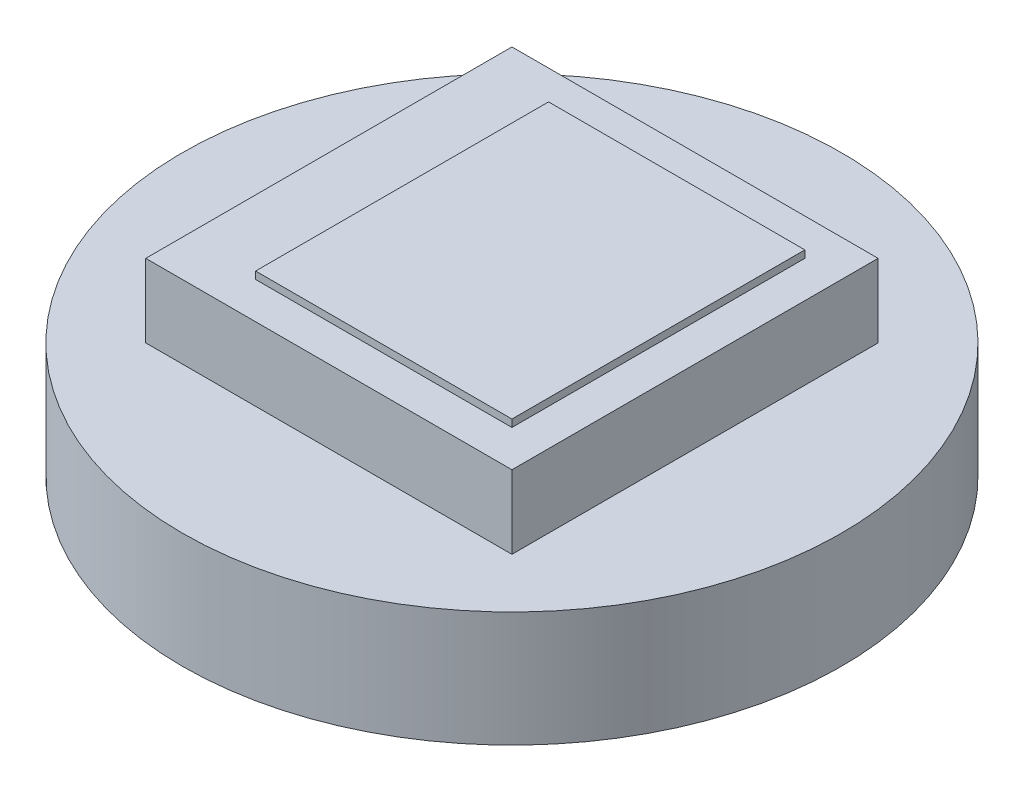
ISO-10303-21;
HEADER;
FILE_DESCRIPTION(('STEP AP214'),'2;1');
FILE_NAME('part.step','',(''),(''),'','','');
FILE_SCHEMA(('AUTOMOTIVE_DESIGN { 1 0 10303 214 1 1 1 1 }'));
ENDSEC;
DATA;
#1=APPLICATION_CONTEXT('core data for automotive mechanical design processes');
#2=APPLICATION_PROTOCOL_DEFINITION('international standard','automotive_design',2000,#1);
#3=PRODUCT_CONTEXT('',#1,'mechanical');
#4=PRODUCT('Part','Part','',(#3));
#5=PRODUCT_RELATED_PRODUCT_CATEGORY('part','',(#4));
#6=PRODUCT_DEFINITION_FORMATION('','',#4);
#7=PRODUCT_DEFINITION_CONTEXT('part definition',#1,'design');
#8=PRODUCT_DEFINITION('design','',#6,#7);
#9=PRODUCT_DEFINITION_SHAPE('','',#8);
#10=(LENGTH_UNIT() NAMED_UNIT(*) SI_UNIT(.MILLI.,.METRE.));
#11=(NAMED_UNIT(*) PLANE_ANGLE_UNIT() SI_UNIT($,.RADIAN.));
#12=(NAMED_UNIT(*) SI_UNIT($,.STERADIAN.) SOLID_ANGLE_UNIT());
#13=UNCERTAINTY_MEASURE_WITH_UNIT(LENGTH_MEASURE(1.E-05),#10,'distance_accuracy_value','');
#14=(GEOMETRIC_REPRESENTATION_CONTEXT(3) GLOBAL_UNCERTAINTY_ASSIGNED_CONTEXT((#13)) GLOBAL_UNIT_ASSIGNED_CONTEXT((#10,
#11,#12)) REPRESENTATION_CONTEXT('',''));
#15=CARTESIAN_POINT('',(0.,0.,0.));
#16=DIRECTION('',(0.,0.,1.));
#17=DIRECTION('',(1.,0.,0.));
#18=AXIS2_PLACEMENT_3D('',#15,#16,#17);
#19=CARTESIAN_POINT('',(-2.5,2.5748,2.5));
#20=DIRECTION('',(0.,1.,0.));
#21=DIRECTION('',(0.,0.,1.));
#22=AXIS2_PLACEMENT_3D('',#19,#20,#21);
#23=PLANE('',#22);
#24=DIRECTION('',(0.,0.,1.));
#25=VECTOR('',#24,1.);
#26=CARTESIAN_POINT('',(-2.5,2.5748,-2.5));
#27=LINE('',#26,#25);
#28=CARTESIAN_POINT('',(-2.5,2.5748,-2.5));
#29=VERTEX_POINT('',#28);
#30=CARTESIAN_POINT('',(-2.5,2.5748,2.5));
#31=VERTEX_POINT('',#30);
#32=EDGE_CURVE('E130',#29,#31,#27,.T.);
#33=ORIENTED_EDGE('',*,*,#32,.T.);
#34=DIRECTION('',(1.,0.,0.));
#35=VECTOR('',#34,1.);
#36=CARTESIAN_POINT('',(-2.5,2.5748,2.5));
#37=LINE('',#36,#35);
#38=CARTESIAN_POINT('',(2.5,2.5748,2.5));
#39=VERTEX_POINT('',#38);
#40=EDGE_CURVE('E133',#31,#39,#37,.T.);
#41=ORIENTED_EDGE('',*,*,#40,.T.);
#42=DIRECTION('',(0.,0.,-1.));
#43=VECTOR('',#42,1.);
#44=CARTESIAN_POINT('',(2.5,2.5748,-2.5));
#45=LINE('',#44,#43);
#46=CARTESIAN_POINT('',(2.5,2.5748,-2.5));
#47=VERTEX_POINT('',#46);
#48=EDGE_CURVE('E136',#39,#47,#45,.T.);
#49=ORIENTED_EDGE('',*,*,#48,.T.);
#50=DIRECTION('',(-1.,0.,0.));
#51=VECTOR('',#50,1.);
#52=CARTESIAN_POINT('',(-2.5,2.5748,-2.5));
#53=LINE('',#52,#51);
#54=EDGE_CURVE('E138',#47,#29,#53,.T.);
#55=ORIENTED_EDGE('',*,*,#54,.T.);
#56=EDGE_LOOP('',(#33,#41,#49,#55));
#57=FACE_BOUND('',#56,.T.);
#58=DIRECTION('',(1.,0.,0.));
#59=VECTOR('',#58,1.);
#60=CARTESIAN_POINT('',(-1.5,2.5748,2.));
#61=LINE('',#60,#59);
#62=CARTESIAN_POINT('',(-1.5,2.5748,2.));
#63=VERTEX_POINT('',#62);
#64=CARTESIAN_POINT('',(2.,2.5748,2.));
#65=VERTEX_POINT('',#64);
#66=EDGE_CURVE('E290',#63,#65,#61,.T.);
#67=ORIENTED_EDGE('',*,*,#66,.F.);
#68=DIRECTION('',(0.,0.,1.));
#69=VECTOR('',#68,1.);
#70=CARTESIAN_POINT('',(-1.5,2.5748,-2.));
#71=LINE('',#70,#69);
#72=CARTESIAN_POINT('',(-1.5,2.5748,-2.));
#73=VERTEX_POINT('',#72);
#74=EDGE_CURVE('E120',#73,#63,#71,.T.);
#75=ORIENTED_EDGE('',*,*,#74,.F.);
#76=DIRECTION('',(-1.,0.,0.));
#77=VECTOR('',#76,1.);
#78=CARTESIAN_POINT('',(-1.5,2.5748,-2.));
#79=LINE('',#78,#77);
#80=CARTESIAN_POINT('',(2.,2.5748,-2.));
#81=VERTEX_POINT('',#80);
#82=EDGE_CURVE('E116',#81,#73,#79,.T.);
#83=ORIENTED_EDGE('',*,*,#82,.F.);
#84=DIRECTION('',(0.,0.,-1.));
#85=VECTOR('',#84,1.);
#86=CARTESIAN_POINT('',(2.,2.5748,-2.));
#87=LINE('',#86,#85);
#88=EDGE_CURVE('E287',#65,#81,#87,.T.);
#89=ORIENTED_EDGE('',*,*,#88,.F.);
#90=EDGE_LOOP('',(#67,#75,#83,#89));
#91=FACE_BOUND('',#90,.T.);
#92=ADVANCED_FACE('F31',(#57,#91),#23,.T.);
#93=CARTESIAN_POINT('',(0.,1.5748,0.));
#94=DIRECTION('',(0.,1.,0.));
#95=DIRECTION('',(0.,0.,1.));
#96=AXIS2_PLACEMENT_3D('',#93,#94,#95);
#97=PLANE('',#96);
#98=CARTESIAN_POINT('',(0.,1.5748,0.));
#99=DIRECTION('',(0.,1.,0.));
#100=DIRECTION('',(0.,0.,1.));
#101=AXIS2_PLACEMENT_3D('',#98,#99,#100);
#102=CIRCLE('',#101,4.5);
#103=CARTESIAN_POINT('',(0.,1.5748,4.5));
#104=VERTEX_POINT('',#103);
#105=EDGE_CURVE('E11',#104,#104,#102,.T.);
#106=ORIENTED_EDGE('',*,*,#105,.T.);
#107=EDGE_LOOP('',(#106));
#108=FACE_BOUND('',#107,.T.);
#109=DIRECTION('',(1.,0.,0.));
#110=VECTOR('',#109,1.);
#111=CARTESIAN_POINT('',(-2.5,1.5748,2.5));
#112=LINE('',#111,#110);
#113=CARTESIAN_POINT('',(-2.5,1.5748,2.5));
#114=VERTEX_POINT('',#113);
#115=CARTESIAN_POINT('',(2.5,1.5748,2.5));
#116=VERTEX_POINT('',#115);
#117=EDGE_CURVE('E125',#114,#116,#112,.T.);
#118=ORIENTED_EDGE('',*,*,#117,.F.);
#119=DIRECTION('',(0.,0.,1.));
#120=VECTOR('',#119,1.);
#121=CARTESIAN_POINT('',(-2.5,1.5748,-2.5));
#122=LINE('',#121,#120);
#123=CARTESIAN_POINT('',(-2.5,1.5748,-2.5));
#124=VERTEX_POINT('',#123);
#125=EDGE_CURVE('E122',#124,#114,#122,.T.);
#126=ORIENTED_EDGE('',*,*,#125,.F.);
#127=DIRECTION('',(-1.,0.,0.));
#128=VECTOR('',#127,1.);
#129=CARTESIAN_POINT('',(-2.5,1.5748,-2.5));
#130=LINE('',#129,#128);
#131=CARTESIAN_POINT('',(2.5,1.5748,-2.5));
#132=VERTEX_POINT('',#131);
#133=EDGE_CURVE('E134',#132,#124,#130,.T.);
#134=ORIENTED_EDGE('',*,*,#133,.F.);
#135=DIRECTION('',(0.,0.,-1.));
#136=VECTOR('',#135,1.);
#137=CARTESIAN_POINT('',(2.5,1.5748,-2.5));
#138=LINE('',#137,#136);
#139=EDGE_CURVE('E142',#116,#132,#138,.T.);
#140=ORIENTED_EDGE('',*,*,#139,.F.);
#141=EDGE_LOOP('',(#118,#126,#134,#140));
#142=FACE_BOUND('',#141,.T.);
#143=ADVANCED_FACE('F169',(#108,#142),#97,.T.);
#144=CARTESIAN_POINT('',(0.,1.5748,0.));
#145=DIRECTION('',(0.,-1.,0.));
#146=DIRECTION('',(0.,0.,-1.));
#147=AXIS2_PLACEMENT_3D('',#144,#145,#146);
#148=CYLINDRICAL_SURFACE('',#147,4.5);
#149=ORIENTED_EDGE('',*,*,#105,.F.);
#150=EDGE_LOOP('',(#149));
#151=FACE_BOUND('',#150,.T.);
#152=CARTESIAN_POINT('',(0.,0.,0.));
#153=DIRECTION('',(0.,1.,0.));
#154=DIRECTION('',(0.,0.,1.));
#155=AXIS2_PLACEMENT_3D('',#152,#153,#154);
#156=CIRCLE('',#155,4.5);
#157=CARTESIAN_POINT('',(0.,0.,4.5));
#158=VERTEX_POINT('',#157);
#159=EDGE_CURVE('E35',#158,#158,#156,.T.);
#160=ORIENTED_EDGE('',*,*,#159,.T.);
#161=EDGE_LOOP('',(#160));
#162=FACE_BOUND('',#161,.T.);
#163=ADVANCED_FACE('F33',(#151,#162),#148,.T.);
#164=CARTESIAN_POINT('',(0.,0.,0.));
#165=DIRECTION('',(0.,1.,0.));
#166=DIRECTION('',(0.,0.,1.));
#167=AXIS2_PLACEMENT_3D('',#164,#165,#166);
#168=PLANE('',#167);
#169=ORIENTED_EDGE('',*,*,#159,.F.);
#170=EDGE_LOOP('',(#169));
#171=FACE_BOUND('',#170,.T.);
#172=ADVANCED_FACE('F158',(#171),#168,.F.);
#173=CARTESIAN_POINT('',(-2.5,2.5748,-2.5));
#174=DIRECTION('',(1.,0.,0.));
#175=DIRECTION('',(0.,0.,-1.));
#176=AXIS2_PLACEMENT_3D('',#173,#174,#175);
#177=PLANE('',#176);
#178=ORIENTED_EDGE('',*,*,#125,.T.);
#179=DIRECTION('',(0.,-1.,0.));
#180=VECTOR('',#179,1.);
#181=CARTESIAN_POINT('',(-2.5,2.5748,2.5));
#182=LINE('',#181,#180);
#183=EDGE_CURVE('E151',#31,#114,#182,.T.);
#184=ORIENTED_EDGE('',*,*,#183,.F.);
#185=ORIENTED_EDGE('',*,*,#32,.F.);
#186=DIRECTION('',(0.,-1.,0.));
#187=VECTOR('',#186,1.);
#188=CARTESIAN_POINT('',(-2.5,2.5748,-2.5));
#189=LINE('',#188,#187);
#190=EDGE_CURVE('E139',#29,#124,#189,.T.);
#191=ORIENTED_EDGE('',*,*,#190,.T.);
#192=EDGE_LOOP('',(#178,#184,#185,#191));
#193=FACE_BOUND('',#192,.T.);
#194=ADVANCED_FACE('F160',(#193),#177,.F.);
#195=CARTESIAN_POINT('',(-2.5,2.5748,2.5));
#196=DIRECTION('',(0.,0.,-1.));
#197=DIRECTION('',(-1.,0.,0.));
#198=AXIS2_PLACEMENT_3D('',#195,#196,#197);
#199=PLANE('',#198);
#200=ORIENTED_EDGE('',*,*,#117,.T.);
#201=DIRECTION('',(0.,-1.,0.));
#202=VECTOR('',#201,1.);
#203=CARTESIAN_POINT('',(2.5,2.5748,2.5));
#204=LINE('',#203,#202);
#205=EDGE_CURVE('E148',#39,#116,#204,.T.);
#206=ORIENTED_EDGE('',*,*,#205,.F.);
#207=ORIENTED_EDGE('',*,*,#40,.F.);
#208=ORIENTED_EDGE('',*,*,#183,.T.);
#209=EDGE_LOOP('',(#200,#206,#207,#208));
#210=FACE_BOUND('',#209,.T.);
#211=ADVANCED_FACE('F166',(#210),#199,.F.);
#212=CARTESIAN_POINT('',(2.5,2.5748,-2.5));
#213=DIRECTION('',(-1.,0.,0.));
#214=DIRECTION('',(0.,0.,1.));
#215=AXIS2_PLACEMENT_3D('',#212,#213,#214);
#216=PLANE('',#215);
#217=ORIENTED_EDGE('',*,*,#139,.T.);
#218=DIRECTION('',(0.,-1.,0.));
#219=VECTOR('',#218,1.);
#220=CARTESIAN_POINT('',(2.5,2.5748,-2.5));
#221=LINE('',#220,#219);
#222=EDGE_CURVE('E54',#47,#132,#221,.T.);
#223=ORIENTED_EDGE('',*,*,#222,.F.);
#224=ORIENTED_EDGE('',*,*,#48,.F.);
#225=ORIENTED_EDGE('',*,*,#205,.T.);
#226=EDGE_LOOP('',(#217,#223,#224,#225));
#227=FACE_BOUND('',#226,.T.);
#228=ADVANCED_FACE('F186',(#227),#216,.F.);
#229=CARTESIAN_POINT('',(-2.5,2.5748,-2.5));
#230=DIRECTION('',(0.,0.,1.));
#231=DIRECTION('',(1.,0.,0.));
#232=AXIS2_PLACEMENT_3D('',#229,#230,#231);
#233=PLANE('',#232);
#234=ORIENTED_EDGE('',*,*,#133,.T.);
#235=ORIENTED_EDGE('',*,*,#190,.F.);
#236=ORIENTED_EDGE('',*,*,#54,.F.);
#237=ORIENTED_EDGE('',*,*,#222,.T.);
#238=EDGE_LOOP('',(#234,#235,#236,#237));
#239=FACE_BOUND('',#238,.T.);
#240=ADVANCED_FACE('F183',(#239),#233,.F.);
#241=CARTESIAN_POINT('',(-1.5,2.6748,-2.));
#242=DIRECTION('',(1.,0.,0.));
#243=DIRECTION('',(0.,0.,-1.));
#244=AXIS2_PLACEMENT_3D('',#241,#242,#243);
#245=PLANE('',#244);
#246=ORIENTED_EDGE('',*,*,#74,.T.);
#247=DIRECTION('',(0.,-1.,0.));
#248=VECTOR('',#247,1.);
#249=CARTESIAN_POINT('',(-1.5,2.6748,2.));
#250=LINE('',#249,#248);
#251=CARTESIAN_POINT('',(-1.5,2.6748,2.));
#252=VERTEX_POINT('',#251);
#253=EDGE_CURVE('E101',#252,#63,#250,.T.);
#254=ORIENTED_EDGE('',*,*,#253,.F.);
#255=DIRECTION('',(0.,0.,1.));
#256=VECTOR('',#255,1.);
#257=CARTESIAN_POINT('',(-1.5,2.6748,-2.));
#258=LINE('',#257,#256);
#259=CARTESIAN_POINT('',(-1.5,2.6748,-2.));
#260=VERTEX_POINT('',#259);
#261=EDGE_CURVE('E108',#260,#252,#258,.T.);
#262=ORIENTED_EDGE('',*,*,#261,.F.);
#263=DIRECTION('',(0.,-1.,0.));
#264=VECTOR('',#263,1.);
#265=CARTESIAN_POINT('',(-1.5,2.6748,-2.));
#266=LINE('',#265,#264);
#267=EDGE_CURVE('E285',#260,#73,#266,.T.);
#268=ORIENTED_EDGE('',*,*,#267,.T.);
#269=EDGE_LOOP('',(#246,#254,#262,#268));
#270=FACE_BOUND('',#269,.T.);
#271=ADVANCED_FACE('F118',(#270),#245,.F.);
#272=CARTESIAN_POINT('',(-1.5,2.6748,2.));
#273=DIRECTION('',(0.,0.,-1.));
#274=DIRECTION('',(-1.,0.,0.));
#275=AXIS2_PLACEMENT_3D('',#272,#273,#274);
#276=PLANE('',#275);
#277=ORIENTED_EDGE('',*,*,#66,.T.);
#278=DIRECTION('',(0.,-1.,0.));
#279=VECTOR('',#278,1.);
#280=CARTESIAN_POINT('',(2.,2.6748,2.));
#281=LINE('',#280,#279);
#282=CARTESIAN_POINT('',(2.,2.6748,2.));
#283=VERTEX_POINT('',#282);
#284=EDGE_CURVE('E104',#283,#65,#281,.T.);
#285=ORIENTED_EDGE('',*,*,#284,.F.);
#286=DIRECTION('',(1.,0.,0.));
#287=VECTOR('',#286,1.);
#288=CARTESIAN_POINT('',(-1.5,2.6748,2.));
#289=LINE('',#288,#287);
#290=EDGE_CURVE('E97',#252,#283,#289,.T.);
#291=ORIENTED_EDGE('',*,*,#290,.F.);
#292=ORIENTED_EDGE('',*,*,#253,.T.);
#293=EDGE_LOOP('',(#277,#285,#291,#292));
#294=FACE_BOUND('',#293,.T.);
#295=ADVANCED_FACE('F99',(#294),#276,.F.);
#296=CARTESIAN_POINT('',(2.,2.6748,-2.));
#297=DIRECTION('',(-1.,0.,0.));
#298=DIRECTION('',(0.,0.,1.));
#299=AXIS2_PLACEMENT_3D('',#296,#297,#298);
#300=PLANE('',#299);
#301=ORIENTED_EDGE('',*,*,#88,.T.);
#302=DIRECTION('',(0.,-1.,0.));
#303=VECTOR('',#302,1.);
#304=CARTESIAN_POINT('',(2.,2.6748,-2.));
#305=LINE('',#304,#303);
#306=CARTESIAN_POINT('',(2.,2.6748,-2.));
#307=VERTEX_POINT('',#306);
#308=EDGE_CURVE('E46',#307,#81,#305,.T.);
#309=ORIENTED_EDGE('',*,*,#308,.F.);
#310=DIRECTION('',(0.,0.,-1.));
#311=VECTOR('',#310,1.);
#312=CARTESIAN_POINT('',(2.,2.6748,-2.));
#313=LINE('',#312,#311);
#314=EDGE_CURVE('E107',#283,#307,#313,.T.);
#315=ORIENTED_EDGE('',*,*,#314,.F.);
#316=ORIENTED_EDGE('',*,*,#284,.T.);
#317=EDGE_LOOP('',(#301,#309,#315,#316));
#318=FACE_BOUND('',#317,.T.);
#319=ADVANCED_FACE('F223',(#318),#300,.F.);
#320=CARTESIAN_POINT('',(-1.5,2.6748,-2.));
#321=DIRECTION('',(0.,0.,1.));
#322=DIRECTION('',(1.,0.,0.));
#323=AXIS2_PLACEMENT_3D('',#320,#321,#322);
#324=PLANE('',#323);
#325=ORIENTED_EDGE('',*,*,#82,.T.);
#326=ORIENTED_EDGE('',*,*,#267,.F.);
#327=DIRECTION('',(-1.,0.,0.));
#328=VECTOR('',#327,1.);
#329=CARTESIAN_POINT('',(-1.5,2.6748,-2.));
#330=LINE('',#329,#328);
#331=EDGE_CURVE('E112',#307,#260,#330,.T.);
#332=ORIENTED_EDGE('',*,*,#331,.F.);
#333=ORIENTED_EDGE('',*,*,#308,.T.);
#334=EDGE_LOOP('',(#325,#326,#332,#333));
#335=FACE_BOUND('',#334,.T.);
#336=ADVANCED_FACE('F229',(#335),#324,.F.);
#337=CARTESIAN_POINT('',(-1.5,2.6748,2.));
#338=DIRECTION('',(0.,1.,0.));
#339=DIRECTION('',(0.,0.,1.));
#340=AXIS2_PLACEMENT_3D('',#337,#338,#339);
#341=PLANE('',#340);
#342=ORIENTED_EDGE('',*,*,#261,.T.);
#343=ORIENTED_EDGE('',*,*,#290,.T.);
#344=ORIENTED_EDGE('',*,*,#314,.T.);
#345=ORIENTED_EDGE('',*,*,#331,.T.);
#346=EDGE_LOOP('',(#342,#343,#344,#345));
#347=FACE_BOUND('',#346,.T.);
#348=ADVANCED_FACE('F111',(#347),#341,.T.);
#349=CLOSED_SHELL('',(#92,#143,#163,#172,#194,#211,#228,#240,#271,#295,#319,#336,#348));
#350=MANIFOLD_SOLID_BREP('B2',#349);
#351=ADVANCED_BREP_SHAPE_REPRESENTATION('',(#18,#350),#14);
#352=SHAPE_DEFINITION_REPRESENTATION(#9,#351);
ENDSEC;
END-ISO-10303-21;
